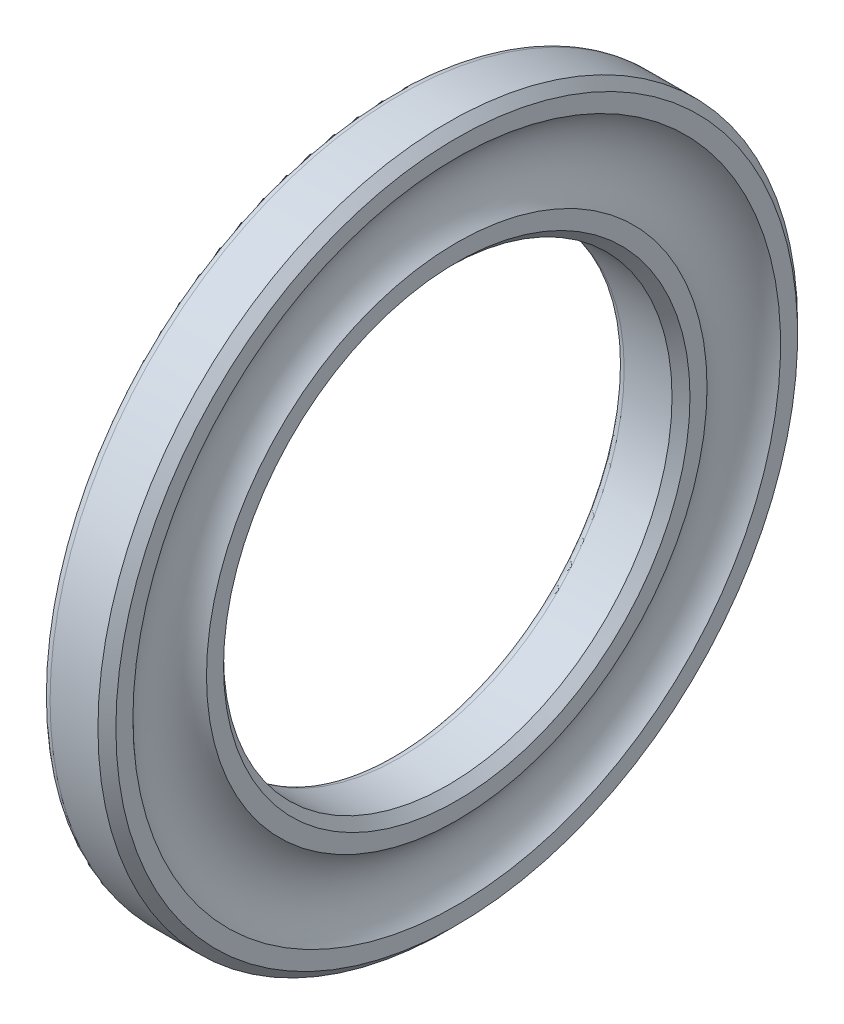
ISO-10303-21;
HEADER;
FILE_DESCRIPTION(('STEP AP214'),'2;1');
FILE_NAME('part.step','',(''),(''),'','','');
FILE_SCHEMA(('AUTOMOTIVE_DESIGN { 1 0 10303 214 1 1 1 1 }'));
ENDSEC;
DATA;
#1=APPLICATION_CONTEXT('core data for automotive mechanical design processes');
#2=APPLICATION_PROTOCOL_DEFINITION('international standard','automotive_design',2000,#1);
#3=PRODUCT_CONTEXT('',#1,'mechanical');
#4=PRODUCT('Part','Part','',(#3));
#5=PRODUCT_RELATED_PRODUCT_CATEGORY('part','',(#4));
#6=PRODUCT_DEFINITION_FORMATION('','',#4);
#7=PRODUCT_DEFINITION_CONTEXT('part definition',#1,'design');
#8=PRODUCT_DEFINITION('design','',#6,#7);
#9=PRODUCT_DEFINITION_SHAPE('','',#8);
#10=(LENGTH_UNIT() NAMED_UNIT(*) SI_UNIT(.MILLI.,.METRE.));
#11=(NAMED_UNIT(*) PLANE_ANGLE_UNIT() SI_UNIT($,.RADIAN.));
#12=(NAMED_UNIT(*) SI_UNIT($,.STERADIAN.) SOLID_ANGLE_UNIT());
#13=UNCERTAINTY_MEASURE_WITH_UNIT(LENGTH_MEASURE(1.E-05),#10,'distance_accuracy_value','');
#14=(GEOMETRIC_REPRESENTATION_CONTEXT(3) GLOBAL_UNCERTAINTY_ASSIGNED_CONTEXT((#13)) GLOBAL_UNIT_ASSIGNED_CONTEXT((#10,
#11,#12)) REPRESENTATION_CONTEXT('',''));
#15=CARTESIAN_POINT('',(0.,0.,0.));
#16=DIRECTION('',(0.,0.,1.));
#17=DIRECTION('',(1.,0.,0.));
#18=AXIS2_PLACEMENT_3D('',#15,#16,#17);
#19=CARTESIAN_POINT('',(1.,0.,0.));
#20=DIRECTION('',(-1.,0.,0.));
#21=DIRECTION('',(0.,0.,1.));
#22=AXIS2_PLACEMENT_3D('',#19,#20,#21);
#23=TOROIDAL_SURFACE('',#22,26.,1.);
#24=CARTESIAN_POINT('',(1.,0.,0.));
#25=DIRECTION('',(-1.,0.,0.));
#26=DIRECTION('',(0.,0.,1.));
#27=AXIS2_PLACEMENT_3D('',#24,#25,#26);
#28=CIRCLE('',#27,25.);
#29=CARTESIAN_POINT('',(1.,0.,25.));
#30=VERTEX_POINT('',#29);
#31=EDGE_CURVE('E9',#30,#30,#28,.T.);
#32=ORIENTED_EDGE('',*,*,#31,.F.);
#33=EDGE_LOOP('',(#32));
#34=FACE_BOUND('',#33,.T.);
#35=CARTESIAN_POINT('',(0.,0.,0.));
#36=DIRECTION('',(-1.,0.,0.));
#37=DIRECTION('',(0.,0.,1.));
#38=AXIS2_PLACEMENT_3D('',#35,#36,#37);
#39=CIRCLE('',#38,26.);
#40=CARTESIAN_POINT('',(0.,0.,26.));
#41=VERTEX_POINT('',#40);
#42=EDGE_CURVE('E63',#41,#41,#39,.T.);
#43=ORIENTED_EDGE('',*,*,#42,.T.);
#44=EDGE_LOOP('',(#43));
#45=FACE_BOUND('',#44,.T.);
#46=ADVANCED_FACE('F13',(#34,#45),#23,.T.);
#47=CARTESIAN_POINT('',(0.,0.,0.));
#48=DIRECTION('',(-1.,0.,0.));
#49=DIRECTION('',(0.,0.,1.));
#50=AXIS2_PLACEMENT_3D('',#47,#48,#49);
#51=CYLINDRICAL_SURFACE('',#50,25.);
#52=CARTESIAN_POINT('',(6.33333333333333,0.,0.));
#53=DIRECTION('',(-1.,0.,0.));
#54=DIRECTION('',(0.,0.,1.));
#55=AXIS2_PLACEMENT_3D('',#52,#53,#54);
#56=CIRCLE('',#55,25.);
#57=CARTESIAN_POINT('',(6.33333333333333,0.,25.));
#58=VERTEX_POINT('',#57);
#59=EDGE_CURVE('E20',#58,#58,#56,.T.);
#60=ORIENTED_EDGE('',*,*,#59,.F.);
#61=EDGE_LOOP('',(#60));
#62=FACE_BOUND('',#61,.T.);
#63=ORIENTED_EDGE('',*,*,#31,.T.);
#64=EDGE_LOOP('',(#63));
#65=FACE_BOUND('',#64,.T.);
#66=ADVANCED_FACE('F112',(#62,#65),#51,.F.);
#67=CARTESIAN_POINT('',(6.33333333333333,0.,0.));
#68=DIRECTION('',(1.,0.,0.));
#69=DIRECTION('',(0.,0.,-1.));
#70=AXIS2_PLACEMENT_3D('',#67,#68,#69);
#71=CONICAL_SURFACE('',#70,25.,0.785398163397449);
#72=CARTESIAN_POINT('',(7.33333333333333,0.,0.));
#73=DIRECTION('',(-1.,0.,0.));
#74=DIRECTION('',(0.,0.,1.));
#75=AXIS2_PLACEMENT_3D('',#72,#73,#74);
#76=CIRCLE('',#75,26.);
#77=CARTESIAN_POINT('',(7.33333333333333,0.,26.));
#78=VERTEX_POINT('',#77);
#79=EDGE_CURVE('E29',#78,#78,#76,.T.);
#80=ORIENTED_EDGE('',*,*,#79,.F.);
#81=EDGE_LOOP('',(#80));
#82=FACE_BOUND('',#81,.T.);
#83=ORIENTED_EDGE('',*,*,#59,.T.);
#84=EDGE_LOOP('',(#83));
#85=FACE_BOUND('',#84,.T.);
#86=ADVANCED_FACE('F108',(#82,#85),#71,.F.);
#87=CARTESIAN_POINT('',(7.33333333333333,26.,0.));
#88=DIRECTION('',(-1.,0.,0.));
#89=DIRECTION('',(0.,0.,1.));
#90=AXIS2_PLACEMENT_3D('',#87,#88,#89);
#91=PLANE('',#90);
#92=CARTESIAN_POINT('',(7.33333333333333,0.,0.));
#93=DIRECTION('',(-1.,0.,0.));
#94=DIRECTION('',(0.,0.,1.));
#95=AXIS2_PLACEMENT_3D('',#92,#93,#94);
#96=CIRCLE('',#95,27.9005420412504);
#97=CARTESIAN_POINT('',(7.33333333333333,0.,27.9005420412504));
#98=VERTEX_POINT('',#97);
#99=EDGE_CURVE('E37',#98,#98,#96,.T.);
#100=ORIENTED_EDGE('',*,*,#99,.F.);
#101=EDGE_LOOP('',(#100));
#102=FACE_BOUND('',#101,.T.);
#103=ORIENTED_EDGE('',*,*,#79,.T.);
#104=EDGE_LOOP('',(#103));
#105=FACE_BOUND('',#104,.T.);
#106=ADVANCED_FACE('F101',(#102,#105),#91,.F.);
#107=CARTESIAN_POINT('',(11.,0.,0.));
#108=DIRECTION('',(-1.,0.,0.));
#109=DIRECTION('',(0.,0.,1.));
#110=AXIS2_PLACEMENT_3D('',#107,#108,#109);
#111=TOROIDAL_SURFACE('',#110,32.,5.5);
#112=ORIENTED_EDGE('',*,*,#99,.T.);
#113=EDGE_LOOP('',(#112));
#114=FACE_BOUND('',#113,.T.);
#115=CARTESIAN_POINT('',(7.33333333333333,0.,0.));
#116=DIRECTION('',(-1.,0.,0.));
#117=DIRECTION('',(0.,0.,1.));
#118=AXIS2_PLACEMENT_3D('',#115,#116,#117);
#119=CIRCLE('',#118,36.0994579587496);
#120=CARTESIAN_POINT('',(7.33333333333333,0.,36.0994579587496));
#121=VERTEX_POINT('',#120);
#122=EDGE_CURVE('E43',#121,#121,#119,.T.);
#123=ORIENTED_EDGE('',*,*,#122,.F.);
#124=EDGE_LOOP('',(#123));
#125=FACE_BOUND('',#124,.T.);
#126=ADVANCED_FACE('F96',(#114,#125),#111,.F.);
#127=CARTESIAN_POINT('',(7.33333333333333,36.0994579587496,0.));
#128=DIRECTION('',(-1.,0.,0.));
#129=DIRECTION('',(0.,0.,1.));
#130=AXIS2_PLACEMENT_3D('',#127,#128,#129);
#131=PLANE('',#130);
#132=CARTESIAN_POINT('',(7.33333333333333,0.,0.));
#133=DIRECTION('',(-1.,0.,0.));
#134=DIRECTION('',(0.,0.,1.));
#135=AXIS2_PLACEMENT_3D('',#132,#133,#134);
#136=CIRCLE('',#135,38.);
#137=CARTESIAN_POINT('',(7.33333333333333,0.,38.));
#138=VERTEX_POINT('',#137);
#139=EDGE_CURVE('E47',#138,#138,#136,.T.);
#140=ORIENTED_EDGE('',*,*,#139,.F.);
#141=EDGE_LOOP('',(#140));
#142=FACE_BOUND('',#141,.T.);
#143=ORIENTED_EDGE('',*,*,#122,.T.);
#144=EDGE_LOOP('',(#143));
#145=FACE_BOUND('',#144,.T.);
#146=ADVANCED_FACE('F90',(#142,#145),#131,.F.);
#147=CARTESIAN_POINT('',(7.33333333333333,0.,0.));
#148=DIRECTION('',(-1.,0.,0.));
#149=DIRECTION('',(0.,0.,1.));
#150=AXIS2_PLACEMENT_3D('',#147,#148,#149);
#151=CONICAL_SURFACE('',#150,38.,0.785398163397449);
#152=CARTESIAN_POINT('',(6.33333333333333,0.,0.));
#153=DIRECTION('',(-1.,0.,0.));
#154=DIRECTION('',(0.,0.,1.));
#155=AXIS2_PLACEMENT_3D('',#152,#153,#154);
#156=CIRCLE('',#155,39.);
#157=CARTESIAN_POINT('',(6.33333333333333,0.,39.));
#158=VERTEX_POINT('',#157);
#159=EDGE_CURVE('E51',#158,#158,#156,.T.);
#160=ORIENTED_EDGE('',*,*,#159,.F.);
#161=EDGE_LOOP('',(#160));
#162=FACE_BOUND('',#161,.T.);
#163=ORIENTED_EDGE('',*,*,#139,.T.);
#164=EDGE_LOOP('',(#163));
#165=FACE_BOUND('',#164,.T.);
#166=ADVANCED_FACE('F84',(#162,#165),#151,.T.);
#167=CARTESIAN_POINT('',(0.,0.,0.));
#168=DIRECTION('',(-1.,0.,0.));
#169=DIRECTION('',(0.,0.,1.));
#170=AXIS2_PLACEMENT_3D('',#167,#168,#169);
#171=CYLINDRICAL_SURFACE('',#170,39.);
#172=CARTESIAN_POINT('',(1.,0.,0.));
#173=DIRECTION('',(-1.,0.,0.));
#174=DIRECTION('',(0.,0.,1.));
#175=AXIS2_PLACEMENT_3D('',#172,#173,#174);
#176=CIRCLE('',#175,39.);
#177=CARTESIAN_POINT('',(1.,0.,39.));
#178=VERTEX_POINT('',#177);
#179=EDGE_CURVE('E55',#178,#178,#176,.T.);
#180=ORIENTED_EDGE('',*,*,#179,.F.);
#181=EDGE_LOOP('',(#180));
#182=FACE_BOUND('',#181,.T.);
#183=ORIENTED_EDGE('',*,*,#159,.T.);
#184=EDGE_LOOP('',(#183));
#185=FACE_BOUND('',#184,.T.);
#186=ADVANCED_FACE('F78',(#182,#185),#171,.T.);
#187=CARTESIAN_POINT('',(1.,0.,0.));
#188=DIRECTION('',(-1.,0.,0.));
#189=DIRECTION('',(0.,0.,1.));
#190=AXIS2_PLACEMENT_3D('',#187,#188,#189);
#191=TOROIDAL_SURFACE('',#190,38.,1.);
#192=CARTESIAN_POINT('',(0.,0.,0.));
#193=DIRECTION('',(-1.,0.,0.));
#194=DIRECTION('',(0.,0.,1.));
#195=AXIS2_PLACEMENT_3D('',#192,#193,#194);
#196=CIRCLE('',#195,38.);
#197=CARTESIAN_POINT('',(0.,0.,38.));
#198=VERTEX_POINT('',#197);
#199=EDGE_CURVE('E59',#198,#198,#196,.T.);
#200=ORIENTED_EDGE('',*,*,#199,.F.);
#201=EDGE_LOOP('',(#200));
#202=FACE_BOUND('',#201,.T.);
#203=ORIENTED_EDGE('',*,*,#179,.T.);
#204=EDGE_LOOP('',(#203));
#205=FACE_BOUND('',#204,.T.);
#206=ADVANCED_FACE('F72',(#202,#205),#191,.T.);
#207=CARTESIAN_POINT('',(0.,38.,0.));
#208=DIRECTION('',(1.,0.,0.));
#209=DIRECTION('',(0.,0.,-1.));
#210=AXIS2_PLACEMENT_3D('',#207,#208,#209);
#211=PLANE('',#210);
#212=ORIENTED_EDGE('',*,*,#42,.F.);
#213=EDGE_LOOP('',(#212));
#214=FACE_BOUND('',#213,.T.);
#215=ORIENTED_EDGE('',*,*,#199,.T.);
#216=EDGE_LOOP('',(#215));
#217=FACE_BOUND('',#216,.T.);
#218=ADVANCED_FACE('F69',(#214,#217),#211,.F.);
#219=CLOSED_SHELL('',(#46,#66,#86,#106,#126,#146,#166,#186,#206,#218));
#220=MANIFOLD_SOLID_BREP('B1',#219);
#221=ADVANCED_BREP_SHAPE_REPRESENTATION('',(#18,#220),#14);
#222=SHAPE_DEFINITION_REPRESENTATION(#9,#221);
ENDSEC;
END-ISO-10303-21;
